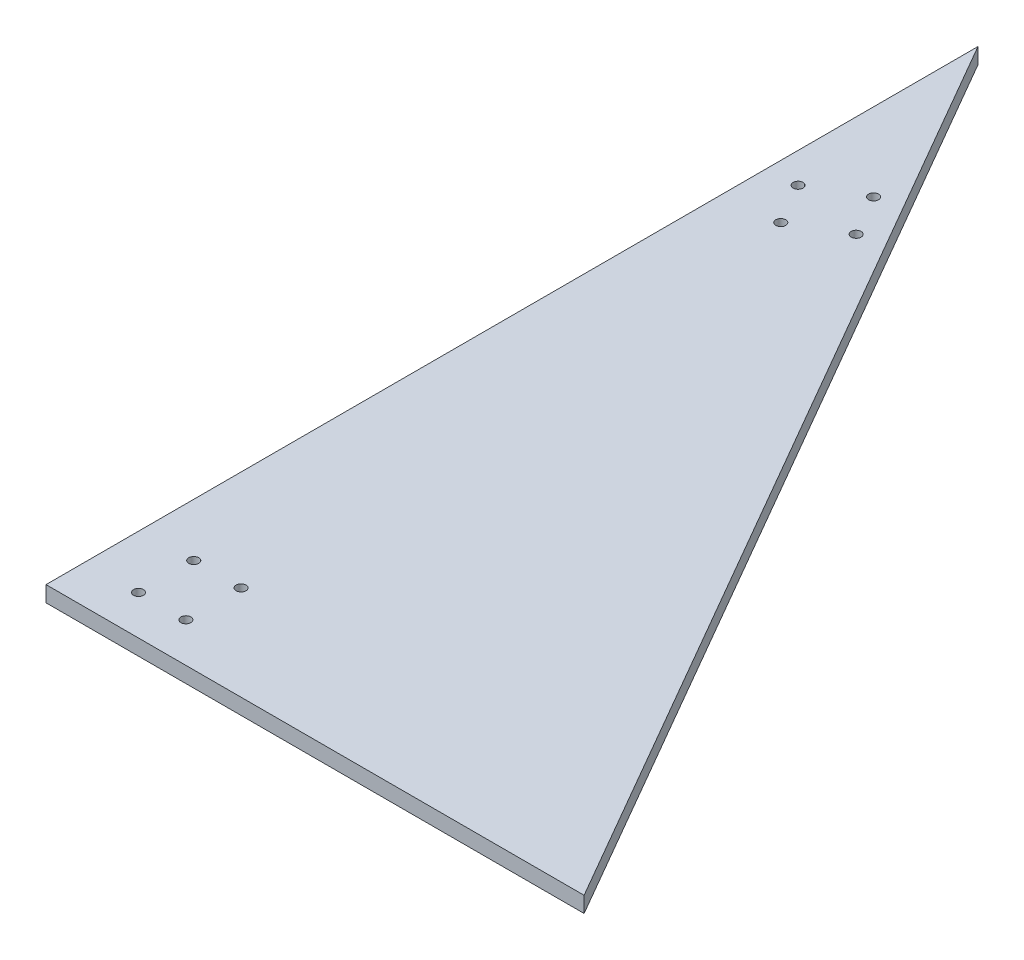
ISO-10303-21;
HEADER;
FILE_DESCRIPTION(('STEP AP214'),'2;1');
FILE_NAME('part.step','',(''),(''),'','','');
FILE_SCHEMA(('AUTOMOTIVE_DESIGN { 1 0 10303 214 1 1 1 1 }'));
ENDSEC;
DATA;
#1=APPLICATION_CONTEXT('core data for automotive mechanical design processes');
#2=APPLICATION_PROTOCOL_DEFINITION('international standard','automotive_design',2000,#1);
#3=PRODUCT_CONTEXT('',#1,'mechanical');
#4=PRODUCT('Part','Part','',(#3));
#5=PRODUCT_RELATED_PRODUCT_CATEGORY('part','',(#4));
#6=PRODUCT_DEFINITION_FORMATION('','',#4);
#7=PRODUCT_DEFINITION_CONTEXT('part definition',#1,'design');
#8=PRODUCT_DEFINITION('design','',#6,#7);
#9=PRODUCT_DEFINITION_SHAPE('','',#8);
#10=(LENGTH_UNIT() NAMED_UNIT(*) SI_UNIT(.MILLI.,.METRE.));
#11=(NAMED_UNIT(*) PLANE_ANGLE_UNIT() SI_UNIT($,.RADIAN.));
#12=(NAMED_UNIT(*) SI_UNIT($,.STERADIAN.) SOLID_ANGLE_UNIT());
#13=UNCERTAINTY_MEASURE_WITH_UNIT(LENGTH_MEASURE(1.E-05),#10,'distance_accuracy_value','');
#14=(GEOMETRIC_REPRESENTATION_CONTEXT(3) GLOBAL_UNCERTAINTY_ASSIGNED_CONTEXT((#13)) GLOBAL_UNIT_ASSIGNED_CONTEXT((#10,
#11,#12)) REPRESENTATION_CONTEXT('',''));
#15=CARTESIAN_POINT('',(0.,0.,0.));
#16=DIRECTION('',(0.,0.,1.));
#17=DIRECTION('',(1.,0.,0.));
#18=AXIS2_PLACEMENT_3D('',#15,#16,#17);
#19=CARTESIAN_POINT('',(0.,6.35,-375.));
#20=DIRECTION('',(1.,0.,0.));
#21=DIRECTION('',(0.,0.,-1.));
#22=AXIS2_PLACEMENT_3D('',#19,#20,#21);
#23=PLANE('',#22);
#24=DIRECTION('',(0.,0.,1.));
#25=VECTOR('',#24,1.);
#26=CARTESIAN_POINT('',(0.,0.,-375.));
#27=LINE('',#26,#25);
#28=CARTESIAN_POINT('',(0.,0.,-375.));
#29=VERTEX_POINT('',#28);
#30=CARTESIAN_POINT('',(0.,0.,0.));
#31=VERTEX_POINT('',#30);
#32=EDGE_CURVE('E82',#29,#31,#27,.T.);
#33=ORIENTED_EDGE('',*,*,#32,.T.);
#34=DIRECTION('',(0.,-1.,0.));
#35=VECTOR('',#34,1.);
#36=CARTESIAN_POINT('',(0.,6.35,0.));
#37=LINE('',#36,#35);
#38=CARTESIAN_POINT('',(0.,6.35,0.));
#39=VERTEX_POINT('',#38);
#40=EDGE_CURVE('E11',#39,#31,#37,.T.);
#41=ORIENTED_EDGE('',*,*,#40,.F.);
#42=DIRECTION('',(0.,0.,1.));
#43=VECTOR('',#42,1.);
#44=CARTESIAN_POINT('',(0.,6.35,-375.));
#45=LINE('',#44,#43);
#46=CARTESIAN_POINT('',(0.,6.35,-375.));
#47=VERTEX_POINT('',#46);
#48=EDGE_CURVE('E75',#47,#39,#45,.T.);
#49=ORIENTED_EDGE('',*,*,#48,.F.);
#50=DIRECTION('',(0.,-1.,0.));
#51=VECTOR('',#50,1.);
#52=CARTESIAN_POINT('',(0.,6.35,-375.));
#53=LINE('',#52,#51);
#54=EDGE_CURVE('E83',#47,#29,#53,.T.);
#55=ORIENTED_EDGE('',*,*,#54,.T.);
#56=EDGE_LOOP('',(#33,#41,#49,#55));
#57=FACE_BOUND('',#56,.T.);
#58=ADVANCED_FACE('F33',(#57),#23,.F.);
#59=CARTESIAN_POINT('',(0.,6.35,0.));
#60=DIRECTION('',(0.,0.,-1.));
#61=DIRECTION('',(-1.,0.,0.));
#62=AXIS2_PLACEMENT_3D('',#59,#60,#61);
#63=PLANE('',#62);
#64=DIRECTION('',(1.,0.,0.));
#65=VECTOR('',#64,1.);
#66=CARTESIAN_POINT('',(0.,0.,0.));
#67=LINE('',#66,#65);
#68=CARTESIAN_POINT('',(216.51,0.,0.));
#69=VERTEX_POINT('',#68);
#70=EDGE_CURVE('E63',#31,#69,#67,.T.);
#71=ORIENTED_EDGE('',*,*,#70,.T.);
#72=DIRECTION('',(0.,-1.,0.));
#73=VECTOR('',#72,1.);
#74=CARTESIAN_POINT('',(216.51,6.35,0.));
#75=LINE('',#74,#73);
#76=CARTESIAN_POINT('',(216.51,6.35,0.));
#77=VERTEX_POINT('',#76);
#78=EDGE_CURVE('E42',#77,#69,#75,.T.);
#79=ORIENTED_EDGE('',*,*,#78,.F.);
#80=DIRECTION('',(1.,0.,0.));
#81=VECTOR('',#80,1.);
#82=CARTESIAN_POINT('',(0.,6.35,0.));
#83=LINE('',#82,#81);
#84=EDGE_CURVE('E71',#39,#77,#83,.T.);
#85=ORIENTED_EDGE('',*,*,#84,.F.);
#86=ORIENTED_EDGE('',*,*,#40,.T.);
#87=EDGE_LOOP('',(#71,#79,#85,#86));
#88=FACE_BOUND('',#87,.T.);
#89=ADVANCED_FACE('F72',(#88),#63,.F.);
#90=CARTESIAN_POINT('',(216.51,6.35,0.));
#91=DIRECTION('',(-0.866021754722861,0.,0.500006320306791));
#92=DIRECTION('',(0.500006320306791,0.,0.866021754722861));
#93=AXIS2_PLACEMENT_3D('',#90,#91,#92);
#94=PLANE('',#93);
#95=DIRECTION('',(-0.500006320306791,0.,-0.866021754722861));
#96=VECTOR('',#95,1.);
#97=CARTESIAN_POINT('',(216.51,0.,0.));
#98=LINE('',#97,#96);
#99=EDGE_CURVE('E68',#69,#29,#98,.T.);
#100=ORIENTED_EDGE('',*,*,#99,.T.);
#101=ORIENTED_EDGE('',*,*,#54,.F.);
#102=DIRECTION('',(-0.500006320306791,0.,-0.866021754722861));
#103=VECTOR('',#102,1.);
#104=CARTESIAN_POINT('',(216.51,6.35,0.));
#105=LINE('',#104,#103);
#106=EDGE_CURVE('E51',#77,#47,#105,.T.);
#107=ORIENTED_EDGE('',*,*,#106,.F.);
#108=ORIENTED_EDGE('',*,*,#78,.T.);
#109=EDGE_LOOP('',(#100,#101,#107,#108));
#110=FACE_BOUND('',#109,.T.);
#111=ADVANCED_FACE('F130',(#110),#94,.F.);
#112=CARTESIAN_POINT('',(0.,6.35,0.));
#113=DIRECTION('',(0.,1.,0.));
#114=DIRECTION('',(0.,0.,1.));
#115=AXIS2_PLACEMENT_3D('',#112,#113,#114);
#116=PLANE('',#115);
#117=CARTESIAN_POINT('',(31.3950971047041,6.35,-301.573253990502));
#118=DIRECTION('',(0.,1.,0.));
#119=DIRECTION('',(0.,0.,1.));
#120=AXIS2_PLACEMENT_3D('',#117,#118,#119);
#121=CIRCLE('',#120,1.99999999999999);
#122=CARTESIAN_POINT('',(31.3950971047041,6.35,-299.573253990502));
#123=VERTEX_POINT('',#122);
#124=EDGE_CURVE('E245',#123,#123,#121,.T.);
#125=ORIENTED_EDGE('',*,*,#124,.F.);
#126=EDGE_LOOP('',(#125));
#127=FACE_BOUND('',#126,.T.);
#128=CARTESIAN_POINT('',(21.6728840078329,6.35,-273.962899094213));
#129=DIRECTION('',(0.,1.,0.));
#130=DIRECTION('',(0.,0.,1.));
#131=AXIS2_PLACEMENT_3D('',#128,#129,#130);
#132=CIRCLE('',#131,1.99999999999999);
#133=CARTESIAN_POINT('',(21.6728840078329,6.35,-271.962899094213));
#134=VERTEX_POINT('',#133);
#135=EDGE_CURVE('E36',#134,#134,#132,.T.);
#136=ORIENTED_EDGE('',*,*,#135,.F.);
#137=EDGE_LOOP('',(#136));
#138=FACE_BOUND('',#137,.T.);
#139=CARTESIAN_POINT('',(40.4000000000001,6.35,-38.1));
#140=DIRECTION('',(0.,1.,0.));
#141=DIRECTION('',(0.,0.,1.));
#142=AXIS2_PLACEMENT_3D('',#139,#140,#141);
#143=CIRCLE('',#142,1.99999999999999);
#144=CARTESIAN_POINT('',(40.4000000000001,6.35,-36.1));
#145=VERTEX_POINT('',#144);
#146=EDGE_CURVE('E258',#145,#145,#143,.T.);
#147=ORIENTED_EDGE('',*,*,#146,.F.);
#148=EDGE_LOOP('',(#147));
#149=FACE_BOUND('',#148,.T.);
#150=CARTESIAN_POINT('',(21.3500000000001,6.35,-15.8750000000001));
#151=DIRECTION('',(0.,1.,0.));
#152=DIRECTION('',(0.,0.,1.));
#153=AXIS2_PLACEMENT_3D('',#150,#151,#152);
#154=CIRCLE('',#153,1.99999999999999);
#155=CARTESIAN_POINT('',(21.3500000000001,6.35,-13.8750000000001));
#156=VERTEX_POINT('',#155);
#157=EDGE_CURVE('E111',#156,#156,#154,.T.);
#158=ORIENTED_EDGE('',*,*,#157,.F.);
#159=EDGE_LOOP('',(#158));
#160=FACE_BOUND('',#159,.T.);
#161=CARTESIAN_POINT('',(12.1477636059885,6.35000000000002,-290.460613521684));
#162=DIRECTION('',(0.,1.,0.));
#163=DIRECTION('',(0.,0.,1.));
#164=AXIS2_PLACEMENT_3D('',#161,#162,#163);
#165=CIRCLE('',#164,1.99999999999999);
#166=CARTESIAN_POINT('',(12.1477636059885,6.35000000000002,-288.460613521684));
#167=VERTEX_POINT('',#166);
#168=EDGE_CURVE('E105',#167,#167,#165,.T.);
#169=ORIENTED_EDGE('',*,*,#168,.F.);
#170=EDGE_LOOP('',(#169));
#171=FACE_BOUND('',#170,.T.);
#172=CARTESIAN_POINT('',(40.9202175065484,6.35000000000002,-285.075539563032));
#173=DIRECTION('',(0.,1.,0.));
#174=DIRECTION('',(0.,0.,1.));
#175=AXIS2_PLACEMENT_3D('',#172,#173,#174);
#176=CIRCLE('',#175,1.99999999999999);
#177=CARTESIAN_POINT('',(40.9202175065484,6.35000000000002,-283.075539563032));
#178=VERTEX_POINT('',#177);
#179=EDGE_CURVE('E102',#178,#178,#176,.T.);
#180=ORIENTED_EDGE('',*,*,#179,.F.);
#181=EDGE_LOOP('',(#180));
#182=FACE_BOUND('',#181,.T.);
#183=CARTESIAN_POINT('',(21.35,6.35000000000002,-38.0999999999996));
#184=DIRECTION('',(0.,1.,0.));
#185=DIRECTION('',(0.,0.,1.));
#186=AXIS2_PLACEMENT_3D('',#183,#184,#185);
#187=CIRCLE('',#186,1.99999999999999);
#188=CARTESIAN_POINT('',(21.35,6.35000000000002,-36.0999999999996));
#189=VERTEX_POINT('',#188);
#190=EDGE_CURVE('E99',#189,#189,#187,.T.);
#191=ORIENTED_EDGE('',*,*,#190,.F.);
#192=EDGE_LOOP('',(#191));
#193=FACE_BOUND('',#192,.T.);
#194=CARTESIAN_POINT('',(40.3999999999999,6.35000000000002,-15.8749999999997));
#195=DIRECTION('',(0.,1.,0.));
#196=DIRECTION('',(0.,0.,1.));
#197=AXIS2_PLACEMENT_3D('',#194,#195,#196);
#198=CIRCLE('',#197,1.99999999999999);
#199=CARTESIAN_POINT('',(40.3999999999999,6.35000000000002,-13.8749999999997));
#200=VERTEX_POINT('',#199);
#201=EDGE_CURVE('E89',#200,#200,#198,.T.);
#202=ORIENTED_EDGE('',*,*,#201,.F.);
#203=EDGE_LOOP('',(#202));
#204=FACE_BOUND('',#203,.T.);
#205=ORIENTED_EDGE('',*,*,#48,.T.);
#206=ORIENTED_EDGE('',*,*,#84,.T.);
#207=ORIENTED_EDGE('',*,*,#106,.T.);
#208=EDGE_LOOP('',(#205,#206,#207));
#209=FACE_BOUND('',#208,.T.);
#210=ADVANCED_FACE('F78',(#127,#138,#149,#160,#171,#182,#193,#204,#209),#116,.T.);
#211=CARTESIAN_POINT('',(0.,0.,0.));
#212=DIRECTION('',(0.,1.,0.));
#213=DIRECTION('',(0.,0.,1.));
#214=AXIS2_PLACEMENT_3D('',#211,#212,#213);
#215=PLANE('',#214);
#216=CARTESIAN_POINT('',(31.3950971047041,0.,-301.573253990502));
#217=DIRECTION('',(0.,-1.,0.));
#218=DIRECTION('',(0.,0.,-1.));
#219=AXIS2_PLACEMENT_3D('',#216,#217,#218);
#220=CIRCLE('',#219,1.99999999999999);
#221=CARTESIAN_POINT('',(31.3950971047041,0.,-303.573253990502));
#222=VERTEX_POINT('',#221);
#223=EDGE_CURVE('E248',#222,#222,#220,.T.);
#224=ORIENTED_EDGE('',*,*,#223,.F.);
#225=EDGE_LOOP('',(#224));
#226=FACE_BOUND('',#225,.T.);
#227=CARTESIAN_POINT('',(21.6728840078329,0.,-273.962899094213));
#228=DIRECTION('',(0.,-1.,0.));
#229=DIRECTION('',(0.,0.,-1.));
#230=AXIS2_PLACEMENT_3D('',#227,#228,#229);
#231=CIRCLE('',#230,1.99999999999999);
#232=CARTESIAN_POINT('',(21.6728840078329,0.,-275.962899094213));
#233=VERTEX_POINT('',#232);
#234=EDGE_CURVE('E250',#233,#233,#231,.T.);
#235=ORIENTED_EDGE('',*,*,#234,.F.);
#236=EDGE_LOOP('',(#235));
#237=FACE_BOUND('',#236,.T.);
#238=CARTESIAN_POINT('',(40.4000000000001,0.,-38.1));
#239=DIRECTION('',(0.,-1.,0.));
#240=DIRECTION('',(0.,0.,-1.));
#241=AXIS2_PLACEMENT_3D('',#238,#239,#240);
#242=CIRCLE('',#241,1.99999999999999);
#243=CARTESIAN_POINT('',(40.4000000000001,0.,-40.1));
#244=VERTEX_POINT('',#243);
#245=EDGE_CURVE('E255',#244,#244,#242,.T.);
#246=ORIENTED_EDGE('',*,*,#245,.F.);
#247=EDGE_LOOP('',(#246));
#248=FACE_BOUND('',#247,.T.);
#249=CARTESIAN_POINT('',(21.3500000000001,0.,-15.8750000000001));
#250=DIRECTION('',(0.,-1.,0.));
#251=DIRECTION('',(0.,0.,-1.));
#252=AXIS2_PLACEMENT_3D('',#249,#250,#251);
#253=CIRCLE('',#252,1.99999999999999);
#254=CARTESIAN_POINT('',(21.3500000000001,0.,-17.8750000000001));
#255=VERTEX_POINT('',#254);
#256=EDGE_CURVE('E116',#255,#255,#253,.T.);
#257=ORIENTED_EDGE('',*,*,#256,.F.);
#258=EDGE_LOOP('',(#257));
#259=FACE_BOUND('',#258,.T.);
#260=CARTESIAN_POINT('',(12.1477636059885,0.,-290.460613521684));
#261=DIRECTION('',(0.,1.,0.));
#262=DIRECTION('',(0.,0.,1.));
#263=AXIS2_PLACEMENT_3D('',#260,#261,#262);
#264=CIRCLE('',#263,1.99999999999999);
#265=CARTESIAN_POINT('',(12.1477636059885,0.,-288.460613521684));
#266=VERTEX_POINT('',#265);
#267=EDGE_CURVE('E103',#266,#266,#264,.T.);
#268=ORIENTED_EDGE('',*,*,#267,.T.);
#269=EDGE_LOOP('',(#268));
#270=FACE_BOUND('',#269,.T.);
#271=CARTESIAN_POINT('',(40.9202175065484,0.,-285.075539563032));
#272=DIRECTION('',(0.,1.,0.));
#273=DIRECTION('',(0.,0.,1.));
#274=AXIS2_PLACEMENT_3D('',#271,#272,#273);
#275=CIRCLE('',#274,1.99999999999999);
#276=CARTESIAN_POINT('',(40.9202175065484,0.,-283.075539563032));
#277=VERTEX_POINT('',#276);
#278=EDGE_CURVE('E100',#277,#277,#275,.T.);
#279=ORIENTED_EDGE('',*,*,#278,.T.);
#280=EDGE_LOOP('',(#279));
#281=FACE_BOUND('',#280,.T.);
#282=CARTESIAN_POINT('',(21.35,0.,-38.0999999999996));
#283=DIRECTION('',(0.,1.,0.));
#284=DIRECTION('',(0.,0.,1.));
#285=AXIS2_PLACEMENT_3D('',#282,#283,#284);
#286=CIRCLE('',#285,1.99999999999999);
#287=CARTESIAN_POINT('',(21.35,0.,-36.0999999999996));
#288=VERTEX_POINT('',#287);
#289=EDGE_CURVE('E96',#288,#288,#286,.T.);
#290=ORIENTED_EDGE('',*,*,#289,.T.);
#291=EDGE_LOOP('',(#290));
#292=FACE_BOUND('',#291,.T.);
#293=CARTESIAN_POINT('',(40.3999999999999,0.,-15.8749999999997));
#294=DIRECTION('',(0.,1.,0.));
#295=DIRECTION('',(0.,0.,1.));
#296=AXIS2_PLACEMENT_3D('',#293,#294,#295);
#297=CIRCLE('',#296,1.99999999999999);
#298=CARTESIAN_POINT('',(40.3999999999999,0.,-13.8749999999997));
#299=VERTEX_POINT('',#298);
#300=EDGE_CURVE('E85',#299,#299,#297,.T.);
#301=ORIENTED_EDGE('',*,*,#300,.T.);
#302=EDGE_LOOP('',(#301));
#303=FACE_BOUND('',#302,.T.);
#304=ORIENTED_EDGE('',*,*,#32,.F.);
#305=ORIENTED_EDGE('',*,*,#99,.F.);
#306=ORIENTED_EDGE('',*,*,#70,.F.);
#307=EDGE_LOOP('',(#304,#305,#306));
#308=FACE_BOUND('',#307,.T.);
#309=ADVANCED_FACE('F129',(#226,#237,#248,#259,#270,#281,#292,#303,#308),#215,.F.);
#310=CARTESIAN_POINT('',(40.3999999999999,6.35000000000002,-15.8749999999997));
#311=DIRECTION('',(0.,1.,0.));
#312=DIRECTION('',(0.,0.,1.));
#313=AXIS2_PLACEMENT_3D('',#310,#311,#312);
#314=CYLINDRICAL_SURFACE('',#313,1.99999999999999);
#315=ORIENTED_EDGE('',*,*,#201,.T.);
#316=EDGE_LOOP('',(#315));
#317=FACE_BOUND('',#316,.T.);
#318=ORIENTED_EDGE('',*,*,#300,.F.);
#319=EDGE_LOOP('',(#318));
#320=FACE_BOUND('',#319,.T.);
#321=ADVANCED_FACE('F125',(#317,#320),#314,.F.);
#322=CARTESIAN_POINT('',(21.35,6.35000000000002,-38.0999999999996));
#323=DIRECTION('',(0.,1.,0.));
#324=DIRECTION('',(0.,0.,1.));
#325=AXIS2_PLACEMENT_3D('',#322,#323,#324);
#326=CYLINDRICAL_SURFACE('',#325,1.99999999999999);
#327=ORIENTED_EDGE('',*,*,#190,.T.);
#328=EDGE_LOOP('',(#327));
#329=FACE_BOUND('',#328,.T.);
#330=ORIENTED_EDGE('',*,*,#289,.F.);
#331=EDGE_LOOP('',(#330));
#332=FACE_BOUND('',#331,.T.);
#333=ADVANCED_FACE('F163',(#329,#332),#326,.F.);
#334=CARTESIAN_POINT('',(40.9202175065484,6.35000000000002,-285.075539563032));
#335=DIRECTION('',(0.,1.,0.));
#336=DIRECTION('',(0.,0.,1.));
#337=AXIS2_PLACEMENT_3D('',#334,#335,#336);
#338=CYLINDRICAL_SURFACE('',#337,1.99999999999999);
#339=ORIENTED_EDGE('',*,*,#179,.T.);
#340=EDGE_LOOP('',(#339));
#341=FACE_BOUND('',#340,.T.);
#342=ORIENTED_EDGE('',*,*,#278,.F.);
#343=EDGE_LOOP('',(#342));
#344=FACE_BOUND('',#343,.T.);
#345=ADVANCED_FACE('F172',(#341,#344),#338,.F.);
#346=CARTESIAN_POINT('',(12.1477636059885,6.35000000000002,-290.460613521684));
#347=DIRECTION('',(0.,1.,0.));
#348=DIRECTION('',(0.,0.,1.));
#349=AXIS2_PLACEMENT_3D('',#346,#347,#348);
#350=CYLINDRICAL_SURFACE('',#349,1.99999999999999);
#351=ORIENTED_EDGE('',*,*,#168,.T.);
#352=EDGE_LOOP('',(#351));
#353=FACE_BOUND('',#352,.T.);
#354=ORIENTED_EDGE('',*,*,#267,.F.);
#355=EDGE_LOOP('',(#354));
#356=FACE_BOUND('',#355,.T.);
#357=ADVANCED_FACE('F182',(#353,#356),#350,.F.);
#358=CARTESIAN_POINT('',(21.3500000000001,0.,-15.8750000000001));
#359=DIRECTION('',(0.,-1.,0.));
#360=DIRECTION('',(0.,0.,-1.));
#361=AXIS2_PLACEMENT_3D('',#358,#359,#360);
#362=CYLINDRICAL_SURFACE('',#361,1.99999999999999);
#363=ORIENTED_EDGE('',*,*,#157,.T.);
#364=EDGE_LOOP('',(#363));
#365=FACE_BOUND('',#364,.T.);
#366=ORIENTED_EDGE('',*,*,#256,.T.);
#367=EDGE_LOOP('',(#366));
#368=FACE_BOUND('',#367,.T.);
#369=ADVANCED_FACE('F191',(#365,#368),#362,.F.);
#370=CARTESIAN_POINT('',(40.4000000000001,0.,-38.1));
#371=DIRECTION('',(0.,-1.,0.));
#372=DIRECTION('',(0.,0.,-1.));
#373=AXIS2_PLACEMENT_3D('',#370,#371,#372);
#374=CYLINDRICAL_SURFACE('',#373,1.99999999999999);
#375=ORIENTED_EDGE('',*,*,#146,.T.);
#376=EDGE_LOOP('',(#375));
#377=FACE_BOUND('',#376,.T.);
#378=ORIENTED_EDGE('',*,*,#245,.T.);
#379=EDGE_LOOP('',(#378));
#380=FACE_BOUND('',#379,.T.);
#381=ADVANCED_FACE('F209',(#377,#380),#374,.F.);
#382=CARTESIAN_POINT('',(21.6728840078329,0.,-273.962899094213));
#383=DIRECTION('',(0.,-1.,0.));
#384=DIRECTION('',(0.,0.,-1.));
#385=AXIS2_PLACEMENT_3D('',#382,#383,#384);
#386=CYLINDRICAL_SURFACE('',#385,1.99999999999999);
#387=ORIENTED_EDGE('',*,*,#135,.T.);
#388=EDGE_LOOP('',(#387));
#389=FACE_BOUND('',#388,.T.);
#390=ORIENTED_EDGE('',*,*,#234,.T.);
#391=EDGE_LOOP('',(#390));
#392=FACE_BOUND('',#391,.T.);
#393=ADVANCED_FACE('F219',(#389,#392),#386,.F.);
#394=CARTESIAN_POINT('',(31.3950971047041,0.,-301.573253990502));
#395=DIRECTION('',(0.,-1.,0.));
#396=DIRECTION('',(0.,0.,-1.));
#397=AXIS2_PLACEMENT_3D('',#394,#395,#396);
#398=CYLINDRICAL_SURFACE('',#397,1.99999999999999);
#399=ORIENTED_EDGE('',*,*,#124,.T.);
#400=EDGE_LOOP('',(#399));
#401=FACE_BOUND('',#400,.T.);
#402=ORIENTED_EDGE('',*,*,#223,.T.);
#403=EDGE_LOOP('',(#402));
#404=FACE_BOUND('',#403,.T.);
#405=ADVANCED_FACE('F229',(#401,#404),#398,.F.);
#406=CLOSED_SHELL('',(#58,#89,#111,#210,#309,#321,#333,#345,#357,#369,#381,#393,#405));
#407=MANIFOLD_SOLID_BREP('B2',#406);
#408=ADVANCED_BREP_SHAPE_REPRESENTATION('',(#18,#407),#14);
#409=SHAPE_DEFINITION_REPRESENTATION(#9,#408);
ENDSEC;
END-ISO-10303-21;
